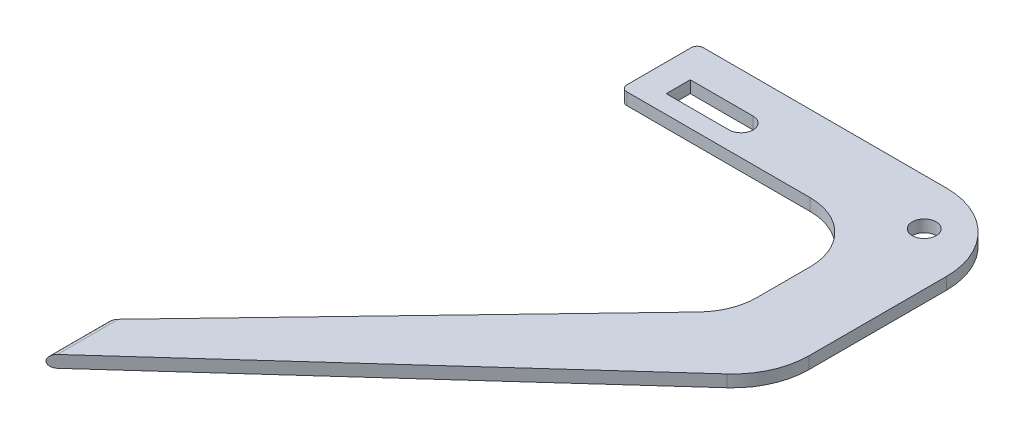
ISO-10303-21;
HEADER;
FILE_DESCRIPTION(('STEP AP214'),'2;1');
FILE_NAME('part.step','',(''),(''),'','','');
FILE_SCHEMA(('AUTOMOTIVE_DESIGN { 1 0 10303 214 1 1 1 1 }'));
ENDSEC;
DATA;
#1=APPLICATION_CONTEXT('core data for automotive mechanical design processes');
#2=APPLICATION_PROTOCOL_DEFINITION('international standard','automotive_design',2000,#1);
#3=PRODUCT_CONTEXT('',#1,'mechanical');
#4=PRODUCT('Part','Part','',(#3));
#5=PRODUCT_RELATED_PRODUCT_CATEGORY('part','',(#4));
#6=PRODUCT_DEFINITION_FORMATION('','',#4);
#7=PRODUCT_DEFINITION_CONTEXT('part definition',#1,'design');
#8=PRODUCT_DEFINITION('design','',#6,#7);
#9=PRODUCT_DEFINITION_SHAPE('','',#8);
#10=(LENGTH_UNIT() NAMED_UNIT(*) SI_UNIT(.MILLI.,.METRE.));
#11=(NAMED_UNIT(*) PLANE_ANGLE_UNIT() SI_UNIT($,.RADIAN.));
#12=(NAMED_UNIT(*) SI_UNIT($,.STERADIAN.) SOLID_ANGLE_UNIT());
#13=UNCERTAINTY_MEASURE_WITH_UNIT(LENGTH_MEASURE(1.E-05),#10,'distance_accuracy_value','');
#14=(GEOMETRIC_REPRESENTATION_CONTEXT(3) GLOBAL_UNCERTAINTY_ASSIGNED_CONTEXT((#13)) GLOBAL_UNIT_ASSIGNED_CONTEXT((#10,
#11,#12)) REPRESENTATION_CONTEXT('',''));
#15=CARTESIAN_POINT('',(0.,0.,0.));
#16=DIRECTION('',(0.,0.,1.));
#17=DIRECTION('',(1.,0.,0.));
#18=AXIS2_PLACEMENT_3D('',#15,#16,#17);
#19=CARTESIAN_POINT('',(-8.51999999999997,1.,49.4391308004906));
#20=DIRECTION('',(0.,0.,-1.));
#21=DIRECTION('',(-1.,0.,0.));
#22=AXIS2_PLACEMENT_3D('',#19,#20,#21);
#23=CYLINDRICAL_SURFACE('',#22,1.);
#24=DIRECTION('',(0.,0.,1.));
#25=VECTOR('',#24,1.);
#26=CARTESIAN_POINT('',(-9.51999999999997,1.,49.4391308004906));
#27=LINE('',#26,#25);
#28=CARTESIAN_POINT('',(-9.51999999999997,1.,49.4391308004906));
#29=VERTEX_POINT('',#28);
#30=CARTESIAN_POINT('',(-9.51999999999997,1.,39.4391308004906));
#31=VERTEX_POINT('',#30);
#32=EDGE_CURVE('E305',#29,#31,#27,.F.);
#33=ORIENTED_EDGE('',*,*,#32,.T.);
#34=CARTESIAN_POINT('',(-8.51999999999997,1.,38.3948031913404));
#35=DIRECTION('',(0.722269362526346,0.,0.691611862214484));
#36=DIRECTION('',(0.691611862214484,0.,-0.722269362526346));
#37=AXIS2_PLACEMENT_3D('',#34,#35,#36);
#38=ELLIPSE('',#37,1.44589769874404,1.);
#39=CARTESIAN_POINT('',(-8.51999999999997,0.,38.3948031913404));
#40=VERTEX_POINT('',#39);
#41=EDGE_CURVE('E42',#40,#31,#38,.F.);
#42=ORIENTED_EDGE('',*,*,#41,.F.);
#43=DIRECTION('',(0.,0.,1.));
#44=VECTOR('',#43,1.);
#45=CARTESIAN_POINT('',(-8.51999999999997,0.,49.4391308004906));
#46=LINE('',#45,#44);
#47=CARTESIAN_POINT('',(-8.51999999999997,0.,48.5349880538304));
#48=VERTEX_POINT('',#47);
#49=EDGE_CURVE('E311',#48,#40,#46,.F.);
#50=ORIENTED_EDGE('',*,*,#49,.F.);
#51=CARTESIAN_POINT('',(-8.51999999999997,1.,48.5349880538304));
#52=DIRECTION('',(-0.670660744195538,0.,-0.741764225475378));
#53=DIRECTION('',(0.741764225475378,0.,-0.670660744195538));
#54=AXIS2_PLACEMENT_3D('',#51,#52,#53);
#55=ELLIPSE('',#54,1.34813727280946,1.);
#56=EDGE_CURVE('E11',#29,#48,#55,.F.);
#57=ORIENTED_EDGE('',*,*,#56,.F.);
#58=EDGE_LOOP('',(#33,#42,#50,#57));
#59=FACE_BOUND('',#58,.T.);
#60=ADVANCED_FACE('F35',(#59),#23,.T.);
#61=CARTESIAN_POINT('',(-8.51999999999997,1.,-17.8372781621066));
#62=DIRECTION('',(0.,0.,1.));
#63=DIRECTION('',(1.,0.,0.));
#64=AXIS2_PLACEMENT_3D('',#61,#62,#63);
#65=CYLINDRICAL_SURFACE('',#64,1.);
#66=DIRECTION('',(0.,0.,1.));
#67=VECTOR('',#66,1.);
#68=CARTESIAN_POINT('',(-8.51999999999997,2.,-17.8372781621066));
#69=LINE('',#68,#67);
#70=CARTESIAN_POINT('',(-8.51999999999997,2.,38.3948031913404));
#71=VERTEX_POINT('',#70);
#72=CARTESIAN_POINT('',(-8.51999999999997,2.,48.5349880538304));
#73=VERTEX_POINT('',#72);
#74=EDGE_CURVE('E302',#71,#73,#69,.T.);
#75=ORIENTED_EDGE('',*,*,#74,.F.);
#76=CARTESIAN_POINT('',(-8.51999999999997,1.,38.3948031913404));
#77=DIRECTION('',(0.722269362526346,0.,0.691611862214484));
#78=DIRECTION('',(-0.691611862214484,0.,0.722269362526346));
#79=AXIS2_PLACEMENT_3D('',#76,#77,#78);
#80=ELLIPSE('',#79,1.44589769874404,1.);
#81=EDGE_CURVE('E307',#31,#71,#80,.F.);
#82=ORIENTED_EDGE('',*,*,#81,.F.);
#83=ORIENTED_EDGE('',*,*,#32,.F.);
#84=CARTESIAN_POINT('',(-8.51999999999997,1.,48.5349880538305));
#85=DIRECTION('',(-0.670660744195538,0.,-0.741764225475378));
#86=DIRECTION('',(-0.741764225475378,0.,0.670660744195538));
#87=AXIS2_PLACEMENT_3D('',#84,#85,#86);
#88=ELLIPSE('',#87,1.34813727280946,1.);
#89=EDGE_CURVE('E309',#73,#29,#88,.F.);
#90=ORIENTED_EDGE('',*,*,#89,.F.);
#91=EDGE_LOOP('',(#75,#82,#83,#90));
#92=FACE_BOUND('',#91,.T.);
#93=ADVANCED_FACE('F318',(#92),#65,.T.);
#94=CARTESIAN_POINT('',(31.48,2.,-17.8372781621066));
#95=DIRECTION('',(0.,-1.,0.));
#96=DIRECTION('',(0.,0.,-1.));
#97=AXIS2_PLACEMENT_3D('',#94,#95,#96);
#98=PLANE('',#97);
#99=CARTESIAN_POINT('',(45.48,2.,-41.7006090805018));
#100=DIRECTION('',(0.,1.,0.));
#101=DIRECTION('',(0.,0.,1.));
#102=AXIS2_PLACEMENT_3D('',#99,#100,#101);
#103=CIRCLE('',#102,2.);
#104=CARTESIAN_POINT('',(45.48,2.,-39.7006090805018));
#105=VERTEX_POINT('',#104);
#106=EDGE_CURVE('E205',#105,#105,#103,.T.);
#107=ORIENTED_EDGE('',*,*,#106,.F.);
#108=EDGE_LOOP('',(#107));
#109=FACE_BOUND('',#108,.T.);
#110=DIRECTION('',(-0.691611862214484,0.,0.722269362526346));
#111=VECTOR('',#110,1.);
#112=CARTESIAN_POINT('',(-9.51999999999997,2.,39.4391308004906));
#113=LINE('',#112,#111);
#114=CARTESIAN_POINT('',(38.7026936252635,2.,-10.9211595399617));
#115=VERTEX_POINT('',#114);
#116=EDGE_CURVE('E214',#115,#71,#113,.T.);
#117=ORIENTED_EDGE('',*,*,#116,.T.);
#118=ORIENTED_EDGE('',*,*,#74,.T.);
#119=DIRECTION('',(0.741764225475378,0.,-0.670660744195538));
#120=VECTOR('',#119,1.);
#121=CARTESIAN_POINT('',(-9.51999999999997,2.,49.4391308004906));
#122=LINE('',#121,#120);
#123=CARTESIAN_POINT('',(50.0113627686555,2.,-4.38571904558265));
#124=VERTEX_POINT('',#123);
#125=EDGE_CURVE('E218',#73,#124,#122,.T.);
#126=ORIENTED_EDGE('',*,*,#125,.T.);
#127=CARTESIAN_POINT('',(41.48,2.,-13.8215772661678));
#128=DIRECTION('',(0.,1.,0.));
#129=DIRECTION('',(0.,0.,1.));
#130=AXIS2_PLACEMENT_3D('',#127,#128,#129);
#131=CIRCLE('',#130,12.7208321681165);
#132=CARTESIAN_POINT('',(54.2008321681165,2.,-13.8215772661678));
#133=VERTEX_POINT('',#132);
#134=EDGE_CURVE('E220',#124,#133,#131,.T.);
#135=ORIENTED_EDGE('',*,*,#134,.T.);
#136=DIRECTION('',(0.,0.,-1.));
#137=VECTOR('',#136,1.);
#138=CARTESIAN_POINT('',(54.2008321681165,2.,-13.8215772661678));
#139=LINE('',#138,#137);
#140=CARTESIAN_POINT('',(54.2008321681165,2.,-36.6920301733855));
#141=VERTEX_POINT('',#140);
#142=EDGE_CURVE('E222',#133,#141,#139,.T.);
#143=ORIENTED_EDGE('',*,*,#142,.T.);
#144=CARTESIAN_POINT('',(41.48,2.,-36.6920301733855));
#145=DIRECTION('',(0.,1.,0.));
#146=DIRECTION('',(0.,0.,1.));
#147=AXIS2_PLACEMENT_3D('',#144,#145,#146);
#148=CIRCLE('',#147,12.7208321681165);
#149=CARTESIAN_POINT('',(41.48,2.,-49.412862341502));
#150=VERTEX_POINT('',#149);
#151=EDGE_CURVE('E224',#141,#150,#148,.T.);
#152=ORIENTED_EDGE('',*,*,#151,.T.);
#153=DIRECTION('',(-1.,0.,0.));
#154=VECTOR('',#153,1.);
#155=CARTESIAN_POINT('',(1.,2.,-49.412862341502));
#156=LINE('',#155,#154);
#157=CARTESIAN_POINT('',(1.,2.,-49.412862341502));
#158=VERTEX_POINT('',#157);
#159=EDGE_CURVE('E226',#150,#158,#156,.T.);
#160=ORIENTED_EDGE('',*,*,#159,.T.);
#161=CARTESIAN_POINT('',(1.,2.,-48.412862341502));
#162=DIRECTION('',(0.,1.,0.));
#163=DIRECTION('',(0.,0.,1.));
#164=AXIS2_PLACEMENT_3D('',#161,#162,#163);
#165=CIRCLE('',#164,1.);
#166=CARTESIAN_POINT('',(0.,2.,-48.412862341502));
#167=VERTEX_POINT('',#166);
#168=EDGE_CURVE('E228',#158,#167,#165,.T.);
#169=ORIENTED_EDGE('',*,*,#168,.T.);
#170=DIRECTION('',(0.,0.,1.));
#171=VECTOR('',#170,1.);
#172=CARTESIAN_POINT('',(0.,2.,-48.412862341502));
#173=LINE('',#172,#171);
#174=CARTESIAN_POINT('',(0.,2.,-37.6920301733855));
#175=VERTEX_POINT('',#174);
#176=EDGE_CURVE('E230',#167,#175,#173,.T.);
#177=ORIENTED_EDGE('',*,*,#176,.T.);
#178=CARTESIAN_POINT('',(1.,2.,-37.6920301733855));
#179=DIRECTION('',(0.,1.,0.));
#180=DIRECTION('',(0.,0.,-1.));
#181=AXIS2_PLACEMENT_3D('',#178,#179,#180);
#182=CIRCLE('',#181,1.);
#183=CARTESIAN_POINT('',(1.,2.,-36.6920301733855));
#184=VERTEX_POINT('',#183);
#185=EDGE_CURVE('E232',#175,#184,#182,.T.);
#186=ORIENTED_EDGE('',*,*,#185,.T.);
#187=DIRECTION('',(1.,0.,0.));
#188=VECTOR('',#187,1.);
#189=CARTESIAN_POINT('',(1.,2.,-36.6920301733855));
#190=LINE('',#189,#188);
#191=CARTESIAN_POINT('',(31.48,2.,-36.6920301733855));
#192=VERTEX_POINT('',#191);
#193=EDGE_CURVE('E234',#184,#192,#190,.T.);
#194=ORIENTED_EDGE('',*,*,#193,.T.);
#195=CARTESIAN_POINT('',(31.48,2.,-26.6920301733855));
#196=DIRECTION('',(0.,-1.,0.));
#197=DIRECTION('',(0.,0.,1.));
#198=AXIS2_PLACEMENT_3D('',#195,#196,#197);
#199=CIRCLE('',#198,10.);
#200=CARTESIAN_POINT('',(41.48,2.,-26.6920301733855));
#201=VERTEX_POINT('',#200);
#202=EDGE_CURVE('E236',#192,#201,#199,.T.);
#203=ORIENTED_EDGE('',*,*,#202,.T.);
#204=DIRECTION('',(0.,0.,1.));
#205=VECTOR('',#204,1.);
#206=CARTESIAN_POINT('',(41.48,2.,-17.8372781621066));
#207=LINE('',#206,#205);
#208=CARTESIAN_POINT('',(41.48,2.,-17.8372781621066));
#209=VERTEX_POINT('',#208);
#210=EDGE_CURVE('E238',#201,#209,#207,.T.);
#211=ORIENTED_EDGE('',*,*,#210,.T.);
#212=CARTESIAN_POINT('',(31.48,2.,-17.8372781621066));
#213=DIRECTION('',(0.,-1.,0.));
#214=DIRECTION('',(0.,0.,-1.));
#215=AXIS2_PLACEMENT_3D('',#212,#213,#214);
#216=CIRCLE('',#215,10.);
#217=EDGE_CURVE('E211',#209,#115,#216,.T.);
#218=ORIENTED_EDGE('',*,*,#217,.T.);
#219=EDGE_LOOP('',(#117,#118,#126,#135,#143,#152,#160,#169,#177,#186,#194,#203,#211,#218));
#220=FACE_BOUND('',#219,.T.);
#221=CARTESIAN_POINT('',(15.,2.,-41.7006090805018));
#222=DIRECTION('',(0.,1.,0.));
#223=DIRECTION('',(0.,0.,1.));
#224=AXIS2_PLACEMENT_3D('',#221,#222,#223);
#225=CIRCLE('',#224,2.);
#226=CARTESIAN_POINT('',(15.,2.,-39.7006090805018));
#227=VERTEX_POINT('',#226);
#228=CARTESIAN_POINT('',(15.,2.,-43.7006090805018));
#229=VERTEX_POINT('',#228);
#230=EDGE_CURVE('E163',#227,#229,#225,.T.);
#231=ORIENTED_EDGE('',*,*,#230,.F.);
#232=DIRECTION('',(1.,0.,0.));
#233=VECTOR('',#232,1.);
#234=CARTESIAN_POINT('',(4.54951644761081,2.,-39.7006090805018));
#235=LINE('',#234,#233);
#236=CARTESIAN_POINT('',(4.54951644761081,2.,-39.7006090805018));
#237=VERTEX_POINT('',#236);
#238=EDGE_CURVE('E189',#237,#227,#235,.T.);
#239=ORIENTED_EDGE('',*,*,#238,.F.);
#240=DIRECTION('',(0.,0.,1.));
#241=VECTOR('',#240,1.);
#242=CARTESIAN_POINT('',(4.54951644761081,2.,-43.7006090805018));
#243=LINE('',#242,#241);
#244=CARTESIAN_POINT('',(4.54951644761081,2.,-43.7006090805018));
#245=VERTEX_POINT('',#244);
#246=EDGE_CURVE('E187',#245,#237,#243,.T.);
#247=ORIENTED_EDGE('',*,*,#246,.F.);
#248=DIRECTION('',(-1.,0.,0.));
#249=VECTOR('',#248,1.);
#250=CARTESIAN_POINT('',(15.,2.,-43.7006090805018));
#251=LINE('',#250,#249);
#252=EDGE_CURVE('E173',#229,#245,#251,.T.);
#253=ORIENTED_EDGE('',*,*,#252,.F.);
#254=EDGE_LOOP('',(#231,#239,#247,#253));
#255=FACE_BOUND('',#254,.T.);
#256=ADVANCED_FACE('F185',(#109,#220,#255),#98,.F.);
#257=CARTESIAN_POINT('',(31.48,0.,-17.8372781621066));
#258=DIRECTION('',(0.,-1.,0.));
#259=DIRECTION('',(0.,0.,-1.));
#260=AXIS2_PLACEMENT_3D('',#257,#258,#259);
#261=PLANE('',#260);
#262=CARTESIAN_POINT('',(45.48,0.,-41.7006090805018));
#263=DIRECTION('',(0.,1.,0.));
#264=DIRECTION('',(0.,0.,1.));
#265=AXIS2_PLACEMENT_3D('',#262,#263,#264);
#266=CIRCLE('',#265,2.);
#267=CARTESIAN_POINT('',(45.48,0.,-39.7006090805018));
#268=VERTEX_POINT('',#267);
#269=EDGE_CURVE('E181',#268,#268,#266,.T.);
#270=ORIENTED_EDGE('',*,*,#269,.T.);
#271=EDGE_LOOP('',(#270));
#272=FACE_BOUND('',#271,.T.);
#273=DIRECTION('',(0.741764225475378,0.,-0.670660744195538));
#274=VECTOR('',#273,1.);
#275=CARTESIAN_POINT('',(-9.51999999999997,0.,49.4391308004906));
#276=LINE('',#275,#274);
#277=CARTESIAN_POINT('',(50.0113627686555,0.,-4.38571904558265));
#278=VERTEX_POINT('',#277);
#279=EDGE_CURVE('E246',#48,#278,#276,.T.);
#280=ORIENTED_EDGE('',*,*,#279,.F.);
#281=ORIENTED_EDGE('',*,*,#49,.T.);
#282=DIRECTION('',(-0.691611862214484,0.,0.722269362526346));
#283=VECTOR('',#282,1.);
#284=CARTESIAN_POINT('',(-9.51999999999997,0.,39.4391308004906));
#285=LINE('',#284,#283);
#286=CARTESIAN_POINT('',(38.7026936252635,0.,-10.9211595399617));
#287=VERTEX_POINT('',#286);
#288=EDGE_CURVE('E243',#287,#40,#285,.T.);
#289=ORIENTED_EDGE('',*,*,#288,.F.);
#290=CARTESIAN_POINT('',(31.48,0.,-17.8372781621066));
#291=DIRECTION('',(0.,-1.,0.));
#292=DIRECTION('',(0.,0.,-1.));
#293=AXIS2_PLACEMENT_3D('',#290,#291,#292);
#294=CIRCLE('',#293,10.);
#295=CARTESIAN_POINT('',(41.48,0.,-17.8372781621066));
#296=VERTEX_POINT('',#295);
#297=EDGE_CURVE('E208',#296,#287,#294,.T.);
#298=ORIENTED_EDGE('',*,*,#297,.F.);
#299=DIRECTION('',(0.,0.,1.));
#300=VECTOR('',#299,1.);
#301=CARTESIAN_POINT('',(41.48,0.,-17.8372781621066));
#302=LINE('',#301,#300);
#303=CARTESIAN_POINT('',(41.48,0.,-26.6920301733855));
#304=VERTEX_POINT('',#303);
#305=EDGE_CURVE('E215',#304,#296,#302,.T.);
#306=ORIENTED_EDGE('',*,*,#305,.F.);
#307=CARTESIAN_POINT('',(31.48,0.,-26.6920301733855));
#308=DIRECTION('',(0.,-1.,0.));
#309=DIRECTION('',(0.,0.,1.));
#310=AXIS2_PLACEMENT_3D('',#307,#308,#309);
#311=CIRCLE('',#310,10.);
#312=CARTESIAN_POINT('',(31.48,0.,-36.6920301733855));
#313=VERTEX_POINT('',#312);
#314=EDGE_CURVE('E264',#313,#304,#311,.T.);
#315=ORIENTED_EDGE('',*,*,#314,.F.);
#316=DIRECTION('',(1.,0.,0.));
#317=VECTOR('',#316,1.);
#318=CARTESIAN_POINT('',(1.,0.,-36.6920301733855));
#319=LINE('',#318,#317);
#320=CARTESIAN_POINT('',(1.,0.,-36.6920301733855));
#321=VERTEX_POINT('',#320);
#322=EDGE_CURVE('E262',#321,#313,#319,.T.);
#323=ORIENTED_EDGE('',*,*,#322,.F.);
#324=CARTESIAN_POINT('',(1.,0.,-37.6920301733855));
#325=DIRECTION('',(0.,1.,0.));
#326=DIRECTION('',(0.,0.,-1.));
#327=AXIS2_PLACEMENT_3D('',#324,#325,#326);
#328=CIRCLE('',#327,1.);
#329=CARTESIAN_POINT('',(0.,0.,-37.6920301733855));
#330=VERTEX_POINT('',#329);
#331=EDGE_CURVE('E260',#330,#321,#328,.T.);
#332=ORIENTED_EDGE('',*,*,#331,.F.);
#333=DIRECTION('',(0.,0.,1.));
#334=VECTOR('',#333,1.);
#335=CARTESIAN_POINT('',(0.,0.,-48.412862341502));
#336=LINE('',#335,#334);
#337=CARTESIAN_POINT('',(0.,0.,-48.412862341502));
#338=VERTEX_POINT('',#337);
#339=EDGE_CURVE('E258',#338,#330,#336,.T.);
#340=ORIENTED_EDGE('',*,*,#339,.F.);
#341=CARTESIAN_POINT('',(1.,0.,-48.412862341502));
#342=DIRECTION('',(0.,1.,0.));
#343=DIRECTION('',(0.,0.,1.));
#344=AXIS2_PLACEMENT_3D('',#341,#342,#343);
#345=CIRCLE('',#344,1.);
#346=CARTESIAN_POINT('',(1.,0.,-49.412862341502));
#347=VERTEX_POINT('',#346);
#348=EDGE_CURVE('E256',#347,#338,#345,.T.);
#349=ORIENTED_EDGE('',*,*,#348,.F.);
#350=DIRECTION('',(-1.,0.,0.));
#351=VECTOR('',#350,1.);
#352=CARTESIAN_POINT('',(1.,0.,-49.412862341502));
#353=LINE('',#352,#351);
#354=CARTESIAN_POINT('',(41.48,0.,-49.412862341502));
#355=VERTEX_POINT('',#354);
#356=EDGE_CURVE('E254',#355,#347,#353,.T.);
#357=ORIENTED_EDGE('',*,*,#356,.F.);
#358=CARTESIAN_POINT('',(41.48,0.,-36.6920301733855));
#359=DIRECTION('',(0.,1.,0.));
#360=DIRECTION('',(0.,0.,1.));
#361=AXIS2_PLACEMENT_3D('',#358,#359,#360);
#362=CIRCLE('',#361,12.7208321681165);
#363=CARTESIAN_POINT('',(54.2008321681165,0.,-36.6920301733855));
#364=VERTEX_POINT('',#363);
#365=EDGE_CURVE('E252',#364,#355,#362,.T.);
#366=ORIENTED_EDGE('',*,*,#365,.F.);
#367=DIRECTION('',(0.,0.,-1.));
#368=VECTOR('',#367,1.);
#369=CARTESIAN_POINT('',(54.2008321681165,0.,-13.8215772661678));
#370=LINE('',#369,#368);
#371=CARTESIAN_POINT('',(54.2008321681165,0.,-13.8215772661678));
#372=VERTEX_POINT('',#371);
#373=EDGE_CURVE('E250',#372,#364,#370,.T.);
#374=ORIENTED_EDGE('',*,*,#373,.F.);
#375=CARTESIAN_POINT('',(41.48,0.,-13.8215772661678));
#376=DIRECTION('',(0.,1.,0.));
#377=DIRECTION('',(0.,0.,1.));
#378=AXIS2_PLACEMENT_3D('',#375,#376,#377);
#379=CIRCLE('',#378,12.7208321681165);
#380=EDGE_CURVE('E248',#278,#372,#379,.T.);
#381=ORIENTED_EDGE('',*,*,#380,.F.);
#382=EDGE_LOOP('',(#280,#281,#289,#298,#306,#315,#323,#332,#340,#349,#357,#366,#374,#381));
#383=FACE_BOUND('',#382,.T.);
#384=DIRECTION('',(1.,0.,0.));
#385=VECTOR('',#384,1.);
#386=CARTESIAN_POINT('',(4.54951644761081,0.,-39.7006090805018));
#387=LINE('',#386,#385);
#388=CARTESIAN_POINT('',(4.54951644761081,0.,-39.7006090805018));
#389=VERTEX_POINT('',#388);
#390=CARTESIAN_POINT('',(15.,0.,-39.7006090805018));
#391=VERTEX_POINT('',#390);
#392=EDGE_CURVE('E174',#389,#391,#387,.T.);
#393=ORIENTED_EDGE('',*,*,#392,.T.);
#394=CARTESIAN_POINT('',(15.,0.,-41.7006090805018));
#395=DIRECTION('',(0.,1.,0.));
#396=DIRECTION('',(0.,0.,1.));
#397=AXIS2_PLACEMENT_3D('',#394,#395,#396);
#398=CIRCLE('',#397,2.);
#399=CARTESIAN_POINT('',(15.,0.,-43.7006090805018));
#400=VERTEX_POINT('',#399);
#401=EDGE_CURVE('E193',#391,#400,#398,.T.);
#402=ORIENTED_EDGE('',*,*,#401,.T.);
#403=DIRECTION('',(-1.,0.,0.));
#404=VECTOR('',#403,1.);
#405=CARTESIAN_POINT('',(15.,0.,-43.7006090805018));
#406=LINE('',#405,#404);
#407=CARTESIAN_POINT('',(4.54951644761081,0.,-43.7006090805018));
#408=VERTEX_POINT('',#407);
#409=EDGE_CURVE('E180',#400,#408,#406,.T.);
#410=ORIENTED_EDGE('',*,*,#409,.T.);
#411=DIRECTION('',(0.,0.,1.));
#412=VECTOR('',#411,1.);
#413=CARTESIAN_POINT('',(4.54951644761081,0.,-43.7006090805018));
#414=LINE('',#413,#412);
#415=EDGE_CURVE('E196',#408,#389,#414,.T.);
#416=ORIENTED_EDGE('',*,*,#415,.T.);
#417=EDGE_LOOP('',(#393,#402,#410,#416));
#418=FACE_BOUND('',#417,.T.);
#419=ADVANCED_FACE('F332',(#272,#383,#418),#261,.T.);
#420=CARTESIAN_POINT('',(31.48,2.,-17.8372781621066));
#421=DIRECTION('',(0.,-1.,0.));
#422=DIRECTION('',(0.,0.,-1.));
#423=AXIS2_PLACEMENT_3D('',#420,#421,#422);
#424=CYLINDRICAL_SURFACE('',#423,10.);
#425=ORIENTED_EDGE('',*,*,#297,.T.);
#426=DIRECTION('',(0.,-1.,0.));
#427=VECTOR('',#426,1.);
#428=CARTESIAN_POINT('',(38.7026936252635,2.,-10.9211595399617));
#429=LINE('',#428,#427);
#430=EDGE_CURVE('E299',#115,#287,#429,.T.);
#431=ORIENTED_EDGE('',*,*,#430,.F.);
#432=ORIENTED_EDGE('',*,*,#217,.F.);
#433=DIRECTION('',(0.,-1.,0.));
#434=VECTOR('',#433,1.);
#435=CARTESIAN_POINT('',(41.48,2.,-17.8372781621066));
#436=LINE('',#435,#434);
#437=EDGE_CURVE('E240',#209,#296,#436,.T.);
#438=ORIENTED_EDGE('',*,*,#437,.T.);
#439=EDGE_LOOP('',(#425,#431,#432,#438));
#440=FACE_BOUND('',#439,.T.);
#441=ADVANCED_FACE('F328',(#440),#424,.F.);
#442=CARTESIAN_POINT('',(-9.51999999999997,2.,39.4391308004906));
#443=DIRECTION('',(0.722269362526346,0.,0.691611862214484));
#444=DIRECTION('',(0.691611862214484,0.,-0.722269362526346));
#445=AXIS2_PLACEMENT_3D('',#442,#443,#444);
#446=PLANE('',#445);
#447=ORIENTED_EDGE('',*,*,#288,.T.);
#448=ORIENTED_EDGE('',*,*,#41,.T.);
#449=ORIENTED_EDGE('',*,*,#81,.T.);
#450=ORIENTED_EDGE('',*,*,#116,.F.);
#451=ORIENTED_EDGE('',*,*,#430,.T.);
#452=EDGE_LOOP('',(#447,#448,#449,#450,#451));
#453=FACE_BOUND('',#452,.T.);
#454=ADVANCED_FACE('F314',(#453),#446,.F.);
#455=CARTESIAN_POINT('',(-9.51999999999997,2.,49.4391308004906));
#456=DIRECTION('',(-0.670660744195538,0.,-0.741764225475378));
#457=DIRECTION('',(-0.741764225475378,0.,0.670660744195538));
#458=AXIS2_PLACEMENT_3D('',#455,#456,#457);
#459=PLANE('',#458);
#460=ORIENTED_EDGE('',*,*,#89,.T.);
#461=ORIENTED_EDGE('',*,*,#56,.T.);
#462=ORIENTED_EDGE('',*,*,#279,.T.);
#463=DIRECTION('',(0.,-1.,0.));
#464=VECTOR('',#463,1.);
#465=CARTESIAN_POINT('',(50.0113627686555,2.,-4.38571904558265));
#466=LINE('',#465,#464);
#467=EDGE_CURVE('E296',#124,#278,#466,.T.);
#468=ORIENTED_EDGE('',*,*,#467,.F.);
#469=ORIENTED_EDGE('',*,*,#125,.F.);
#470=EDGE_LOOP('',(#460,#461,#462,#468,#469));
#471=FACE_BOUND('',#470,.T.);
#472=ADVANCED_FACE('F321',(#471),#459,.F.);
#473=CARTESIAN_POINT('',(41.48,2.,-13.8215772661678));
#474=DIRECTION('',(0.,-1.,0.));
#475=DIRECTION('',(0.,0.,-1.));
#476=AXIS2_PLACEMENT_3D('',#473,#474,#475);
#477=CYLINDRICAL_SURFACE('',#476,12.7208321681165);
#478=ORIENTED_EDGE('',*,*,#380,.T.);
#479=DIRECTION('',(0.,-1.,0.));
#480=VECTOR('',#479,1.);
#481=CARTESIAN_POINT('',(54.2008321681165,2.,-13.8215772661678));
#482=LINE('',#481,#480);
#483=EDGE_CURVE('E293',#133,#372,#482,.T.);
#484=ORIENTED_EDGE('',*,*,#483,.F.);
#485=ORIENTED_EDGE('',*,*,#134,.F.);
#486=ORIENTED_EDGE('',*,*,#467,.T.);
#487=EDGE_LOOP('',(#478,#484,#485,#486));
#488=FACE_BOUND('',#487,.T.);
#489=ADVANCED_FACE('F339',(#488),#477,.T.);
#490=CARTESIAN_POINT('',(54.2008321681165,2.,-13.8215772661678));
#491=DIRECTION('',(-1.,0.,0.));
#492=DIRECTION('',(0.,0.,1.));
#493=AXIS2_PLACEMENT_3D('',#490,#491,#492);
#494=PLANE('',#493);
#495=ORIENTED_EDGE('',*,*,#373,.T.);
#496=DIRECTION('',(0.,-1.,0.));
#497=VECTOR('',#496,1.);
#498=CARTESIAN_POINT('',(54.2008321681165,2.,-36.6920301733855));
#499=LINE('',#498,#497);
#500=EDGE_CURVE('E290',#141,#364,#499,.T.);
#501=ORIENTED_EDGE('',*,*,#500,.F.);
#502=ORIENTED_EDGE('',*,*,#142,.F.);
#503=ORIENTED_EDGE('',*,*,#483,.T.);
#504=EDGE_LOOP('',(#495,#501,#502,#503));
#505=FACE_BOUND('',#504,.T.);
#506=ADVANCED_FACE('F346',(#505),#494,.F.);
#507=CARTESIAN_POINT('',(41.48,2.,-36.6920301733855));
#508=DIRECTION('',(0.,-1.,0.));
#509=DIRECTION('',(0.,0.,-1.));
#510=AXIS2_PLACEMENT_3D('',#507,#508,#509);
#511=CYLINDRICAL_SURFACE('',#510,12.7208321681165);
#512=ORIENTED_EDGE('',*,*,#365,.T.);
#513=DIRECTION('',(0.,-1.,0.));
#514=VECTOR('',#513,1.);
#515=CARTESIAN_POINT('',(41.48,2.,-49.412862341502));
#516=LINE('',#515,#514);
#517=EDGE_CURVE('E287',#150,#355,#516,.T.);
#518=ORIENTED_EDGE('',*,*,#517,.F.);
#519=ORIENTED_EDGE('',*,*,#151,.F.);
#520=ORIENTED_EDGE('',*,*,#500,.T.);
#521=EDGE_LOOP('',(#512,#518,#519,#520));
#522=FACE_BOUND('',#521,.T.);
#523=ADVANCED_FACE('F349',(#522),#511,.T.);
#524=CARTESIAN_POINT('',(1.,2.,-49.412862341502));
#525=DIRECTION('',(0.,0.,1.));
#526=DIRECTION('',(1.,0.,0.));
#527=AXIS2_PLACEMENT_3D('',#524,#525,#526);
#528=PLANE('',#527);
#529=ORIENTED_EDGE('',*,*,#356,.T.);
#530=DIRECTION('',(0.,-1.,0.));
#531=VECTOR('',#530,1.);
#532=CARTESIAN_POINT('',(1.,2.,-49.412862341502));
#533=LINE('',#532,#531);
#534=EDGE_CURVE('E284',#158,#347,#533,.T.);
#535=ORIENTED_EDGE('',*,*,#534,.F.);
#536=ORIENTED_EDGE('',*,*,#159,.F.);
#537=ORIENTED_EDGE('',*,*,#517,.T.);
#538=EDGE_LOOP('',(#529,#535,#536,#537));
#539=FACE_BOUND('',#538,.T.);
#540=ADVANCED_FACE('F354',(#539),#528,.F.);
#541=CARTESIAN_POINT('',(1.,2.,-48.412862341502));
#542=DIRECTION('',(0.,-1.,0.));
#543=DIRECTION('',(0.,0.,-1.));
#544=AXIS2_PLACEMENT_3D('',#541,#542,#543);
#545=CYLINDRICAL_SURFACE('',#544,1.);
#546=ORIENTED_EDGE('',*,*,#348,.T.);
#547=DIRECTION('',(0.,-1.,0.));
#548=VECTOR('',#547,1.);
#549=CARTESIAN_POINT('',(0.,2.,-48.412862341502));
#550=LINE('',#549,#548);
#551=EDGE_CURVE('E281',#167,#338,#550,.T.);
#552=ORIENTED_EDGE('',*,*,#551,.F.);
#553=ORIENTED_EDGE('',*,*,#168,.F.);
#554=ORIENTED_EDGE('',*,*,#534,.T.);
#555=EDGE_LOOP('',(#546,#552,#553,#554));
#556=FACE_BOUND('',#555,.T.);
#557=ADVANCED_FACE('F360',(#556),#545,.T.);
#558=CARTESIAN_POINT('',(0.,2.,-48.412862341502));
#559=DIRECTION('',(1.,0.,0.));
#560=DIRECTION('',(0.,0.,-1.));
#561=AXIS2_PLACEMENT_3D('',#558,#559,#560);
#562=PLANE('',#561);
#563=ORIENTED_EDGE('',*,*,#339,.T.);
#564=DIRECTION('',(0.,-1.,0.));
#565=VECTOR('',#564,1.);
#566=CARTESIAN_POINT('',(0.,2.,-37.6920301733855));
#567=LINE('',#566,#565);
#568=EDGE_CURVE('E278',#175,#330,#567,.T.);
#569=ORIENTED_EDGE('',*,*,#568,.F.);
#570=ORIENTED_EDGE('',*,*,#176,.F.);
#571=ORIENTED_EDGE('',*,*,#551,.T.);
#572=EDGE_LOOP('',(#563,#569,#570,#571));
#573=FACE_BOUND('',#572,.T.);
#574=ADVANCED_FACE('F364',(#573),#562,.F.);
#575=CARTESIAN_POINT('',(1.,2.,-37.6920301733855));
#576=DIRECTION('',(0.,-1.,0.));
#577=DIRECTION('',(0.,0.,-1.));
#578=AXIS2_PLACEMENT_3D('',#575,#576,#577);
#579=CYLINDRICAL_SURFACE('',#578,1.);
#580=ORIENTED_EDGE('',*,*,#331,.T.);
#581=DIRECTION('',(0.,-1.,0.));
#582=VECTOR('',#581,1.);
#583=CARTESIAN_POINT('',(1.,2.,-36.6920301733855));
#584=LINE('',#583,#582);
#585=EDGE_CURVE('E275',#184,#321,#584,.T.);
#586=ORIENTED_EDGE('',*,*,#585,.F.);
#587=ORIENTED_EDGE('',*,*,#185,.F.);
#588=ORIENTED_EDGE('',*,*,#568,.T.);
#589=EDGE_LOOP('',(#580,#586,#587,#588));
#590=FACE_BOUND('',#589,.T.);
#591=ADVANCED_FACE('F369',(#590),#579,.T.);
#592=CARTESIAN_POINT('',(1.,2.,-36.6920301733855));
#593=DIRECTION('',(0.,0.,-1.));
#594=DIRECTION('',(-1.,0.,0.));
#595=AXIS2_PLACEMENT_3D('',#592,#593,#594);
#596=PLANE('',#595);
#597=ORIENTED_EDGE('',*,*,#322,.T.);
#598=DIRECTION('',(0.,-1.,0.));
#599=VECTOR('',#598,1.);
#600=CARTESIAN_POINT('',(31.48,2.,-36.6920301733855));
#601=LINE('',#600,#599);
#602=EDGE_CURVE('E272',#192,#313,#601,.T.);
#603=ORIENTED_EDGE('',*,*,#602,.F.);
#604=ORIENTED_EDGE('',*,*,#193,.F.);
#605=ORIENTED_EDGE('',*,*,#585,.T.);
#606=EDGE_LOOP('',(#597,#603,#604,#605));
#607=FACE_BOUND('',#606,.T.);
#608=ADVANCED_FACE('F375',(#607),#596,.F.);
#609=CARTESIAN_POINT('',(31.48,2.,-26.6920301733855));
#610=DIRECTION('',(0.,-1.,0.));
#611=DIRECTION('',(0.,0.,-1.));
#612=AXIS2_PLACEMENT_3D('',#609,#610,#611);
#613=CYLINDRICAL_SURFACE('',#612,10.);
#614=ORIENTED_EDGE('',*,*,#314,.T.);
#615=DIRECTION('',(0.,-1.,0.));
#616=VECTOR('',#615,1.);
#617=CARTESIAN_POINT('',(41.48,2.,-26.6920301733855));
#618=LINE('',#617,#616);
#619=EDGE_CURVE('E269',#201,#304,#618,.T.);
#620=ORIENTED_EDGE('',*,*,#619,.F.);
#621=ORIENTED_EDGE('',*,*,#202,.F.);
#622=ORIENTED_EDGE('',*,*,#602,.T.);
#623=EDGE_LOOP('',(#614,#620,#621,#622));
#624=FACE_BOUND('',#623,.T.);
#625=ADVANCED_FACE('F378',(#624),#613,.F.);
#626=CARTESIAN_POINT('',(41.48,2.,-17.8372781621066));
#627=DIRECTION('',(1.,0.,0.));
#628=DIRECTION('',(0.,0.,-1.));
#629=AXIS2_PLACEMENT_3D('',#626,#627,#628);
#630=PLANE('',#629);
#631=ORIENTED_EDGE('',*,*,#305,.T.);
#632=ORIENTED_EDGE('',*,*,#437,.F.);
#633=ORIENTED_EDGE('',*,*,#210,.F.);
#634=ORIENTED_EDGE('',*,*,#619,.T.);
#635=EDGE_LOOP('',(#631,#632,#633,#634));
#636=FACE_BOUND('',#635,.T.);
#637=ADVANCED_FACE('F381',(#636),#630,.F.);
#638=CARTESIAN_POINT('',(45.48,2.,-41.7006090805018));
#639=DIRECTION('',(0.,-1.,0.));
#640=DIRECTION('',(0.,0.,-1.));
#641=AXIS2_PLACEMENT_3D('',#638,#639,#640);
#642=CYLINDRICAL_SURFACE('',#641,2.);
#643=ORIENTED_EDGE('',*,*,#106,.T.);
#644=EDGE_LOOP('',(#643));
#645=FACE_BOUND('',#644,.T.);
#646=ORIENTED_EDGE('',*,*,#269,.F.);
#647=EDGE_LOOP('',(#646));
#648=FACE_BOUND('',#647,.T.);
#649=ADVANCED_FACE('F383',(#645,#648),#642,.F.);
#650=CARTESIAN_POINT('',(15.,2.,-41.7006090805018));
#651=DIRECTION('',(0.,-1.,0.));
#652=DIRECTION('',(0.,0.,-1.));
#653=AXIS2_PLACEMENT_3D('',#650,#651,#652);
#654=CYLINDRICAL_SURFACE('',#653,2.);
#655=ORIENTED_EDGE('',*,*,#401,.F.);
#656=DIRECTION('',(0.,-1.,0.));
#657=VECTOR('',#656,1.);
#658=CARTESIAN_POINT('',(15.,2.,-39.7006090805018));
#659=LINE('',#658,#657);
#660=EDGE_CURVE('E169',#227,#391,#659,.T.);
#661=ORIENTED_EDGE('',*,*,#660,.F.);
#662=ORIENTED_EDGE('',*,*,#230,.T.);
#663=DIRECTION('',(0.,-1.,0.));
#664=VECTOR('',#663,1.);
#665=CARTESIAN_POINT('',(15.,2.,-43.7006090805018));
#666=LINE('',#665,#664);
#667=EDGE_CURVE('E166',#229,#400,#666,.T.);
#668=ORIENTED_EDGE('',*,*,#667,.T.);
#669=EDGE_LOOP('',(#655,#661,#662,#668));
#670=FACE_BOUND('',#669,.T.);
#671=ADVANCED_FACE('F165',(#670),#654,.F.);
#672=CARTESIAN_POINT('',(15.,2.,-43.7006090805018));
#673=DIRECTION('',(0.,0.,1.));
#674=DIRECTION('',(1.,0.,0.));
#675=AXIS2_PLACEMENT_3D('',#672,#673,#674);
#676=PLANE('',#675);
#677=ORIENTED_EDGE('',*,*,#409,.F.);
#678=ORIENTED_EDGE('',*,*,#667,.F.);
#679=ORIENTED_EDGE('',*,*,#252,.T.);
#680=DIRECTION('',(0.,-1.,0.));
#681=VECTOR('',#680,1.);
#682=CARTESIAN_POINT('',(4.54951644761081,2.,-43.7006090805018));
#683=LINE('',#682,#681);
#684=EDGE_CURVE('E182',#245,#408,#683,.T.);
#685=ORIENTED_EDGE('',*,*,#684,.T.);
#686=EDGE_LOOP('',(#677,#678,#679,#685));
#687=FACE_BOUND('',#686,.T.);
#688=ADVANCED_FACE('F177',(#687),#676,.T.);
#689=CARTESIAN_POINT('',(4.54951644761081,2.,-43.7006090805018));
#690=DIRECTION('',(1.,0.,0.));
#691=DIRECTION('',(0.,0.,-1.));
#692=AXIS2_PLACEMENT_3D('',#689,#690,#691);
#693=PLANE('',#692);
#694=ORIENTED_EDGE('',*,*,#415,.F.);
#695=ORIENTED_EDGE('',*,*,#684,.F.);
#696=ORIENTED_EDGE('',*,*,#246,.T.);
#697=DIRECTION('',(0.,-1.,0.));
#698=VECTOR('',#697,1.);
#699=CARTESIAN_POINT('',(4.54951644761081,2.,-39.7006090805018));
#700=LINE('',#699,#698);
#701=EDGE_CURVE('E202',#237,#389,#700,.T.);
#702=ORIENTED_EDGE('',*,*,#701,.T.);
#703=EDGE_LOOP('',(#694,#695,#696,#702));
#704=FACE_BOUND('',#703,.T.);
#705=ADVANCED_FACE('F459',(#704),#693,.T.);
#706=CARTESIAN_POINT('',(4.54951644761081,2.,-39.7006090805018));
#707=DIRECTION('',(0.,0.,-1.));
#708=DIRECTION('',(-1.,0.,0.));
#709=AXIS2_PLACEMENT_3D('',#706,#707,#708);
#710=PLANE('',#709);
#711=ORIENTED_EDGE('',*,*,#392,.F.);
#712=ORIENTED_EDGE('',*,*,#701,.F.);
#713=ORIENTED_EDGE('',*,*,#238,.T.);
#714=ORIENTED_EDGE('',*,*,#660,.T.);
#715=EDGE_LOOP('',(#711,#712,#713,#714));
#716=FACE_BOUND('',#715,.T.);
#717=ADVANCED_FACE('F468',(#716),#710,.T.);
#718=CLOSED_SHELL('',(#60,#93,#256,#419,#441,#454,#472,#489,#506,#523,#540,#557,#574,#591,#608,
#625,#637,#649,#671,#688,#705,#717));
#719=MANIFOLD_SOLID_BREP('B2',#718);
#720=ADVANCED_BREP_SHAPE_REPRESENTATION('',(#18,#719),#14);
#721=SHAPE_DEFINITION_REPRESENTATION(#9,#720);
ENDSEC;
END-ISO-10303-21;
